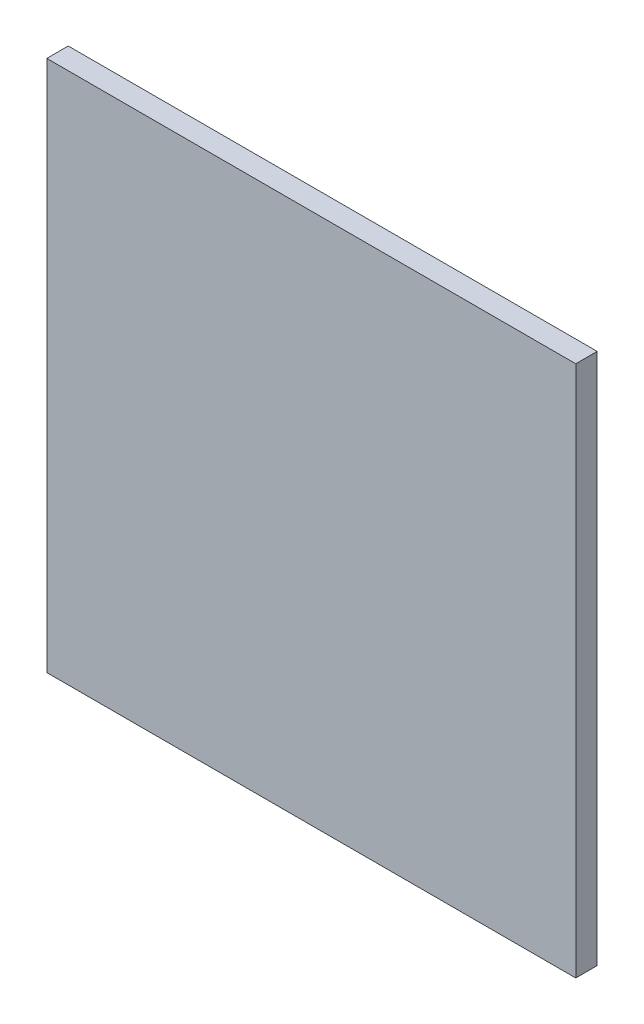
ISO-10303-21;
HEADER;
FILE_DESCRIPTION(('STEP AP214'),'2;1');
FILE_NAME('part.step','',(''),(''),'','','');
FILE_SCHEMA(('AUTOMOTIVE_DESIGN { 1 0 10303 214 1 1 1 1 }'));
ENDSEC;
DATA;
#1=APPLICATION_CONTEXT('core data for automotive mechanical design processes');
#2=APPLICATION_PROTOCOL_DEFINITION('international standard','automotive_design',2000,#1);
#3=PRODUCT_CONTEXT('',#1,'mechanical');
#4=PRODUCT('Part','Part','',(#3));
#5=PRODUCT_RELATED_PRODUCT_CATEGORY('part','',(#4));
#6=PRODUCT_DEFINITION_FORMATION('','',#4);
#7=PRODUCT_DEFINITION_CONTEXT('part definition',#1,'design');
#8=PRODUCT_DEFINITION('design','',#6,#7);
#9=PRODUCT_DEFINITION_SHAPE('','',#8);
#10=(LENGTH_UNIT() NAMED_UNIT(*) SI_UNIT(.MILLI.,.METRE.));
#11=(NAMED_UNIT(*) PLANE_ANGLE_UNIT() SI_UNIT($,.RADIAN.));
#12=(NAMED_UNIT(*) SI_UNIT($,.STERADIAN.) SOLID_ANGLE_UNIT());
#13=UNCERTAINTY_MEASURE_WITH_UNIT(LENGTH_MEASURE(1.E-05),#10,'distance_accuracy_value','');
#14=(GEOMETRIC_REPRESENTATION_CONTEXT(3) GLOBAL_UNCERTAINTY_ASSIGNED_CONTEXT((#13)) GLOBAL_UNIT_ASSIGNED_CONTEXT((#10,
#11,#12)) REPRESENTATION_CONTEXT('',''));
#15=CARTESIAN_POINT('',(0.,0.,0.));
#16=DIRECTION('',(0.,0.,1.));
#17=DIRECTION('',(1.,0.,0.));
#18=AXIS2_PLACEMENT_3D('',#15,#16,#17);
#19=CARTESIAN_POINT('',(-9.83295000067563,239.780501109742,178.407141652104));
#20=DIRECTION('',(1.,0.,0.));
#21=DIRECTION('',(0.,1.,0.));
#22=AXIS2_PLACEMENT_3D('',#19,#20,#21);
#23=PLANE('',#22);
#24=DIRECTION('',(0.,-1.,0.));
#25=VECTOR('',#24,1.);
#26=CARTESIAN_POINT('',(-9.83295000067563,239.780501109742,172.407141652104));
#27=LINE('',#26,#25);
#28=CARTESIAN_POINT('',(-9.83295000067563,239.780501109742,172.407141652104));
#29=VERTEX_POINT('',#28);
#30=CARTESIAN_POINT('',(-9.83295000067561,90.9461939042299,172.407141652104));
#31=VERTEX_POINT('',#30);
#32=EDGE_CURVE('E96',#29,#31,#27,.T.);
#33=ORIENTED_EDGE('',*,*,#32,.T.);
#34=DIRECTION('',(0.,0.,-1.));
#35=VECTOR('',#34,1.);
#36=CARTESIAN_POINT('',(-9.83295000067561,90.9461939042299,178.407141652104));
#37=LINE('',#36,#35);
#38=CARTESIAN_POINT('',(-9.83295000067561,90.9461939042299,178.407141652104));
#39=VERTEX_POINT('',#38);
#40=EDGE_CURVE('E11',#39,#31,#37,.T.);
#41=ORIENTED_EDGE('',*,*,#40,.F.);
#42=DIRECTION('',(0.,-1.,0.));
#43=VECTOR('',#42,1.);
#44=CARTESIAN_POINT('',(-9.83295000067563,239.780501109742,178.407141652104));
#45=LINE('',#44,#43);
#46=CARTESIAN_POINT('',(-9.83295000067563,239.780501109742,178.407141652104));
#47=VERTEX_POINT('',#46);
#48=EDGE_CURVE('E84',#47,#39,#45,.T.);
#49=ORIENTED_EDGE('',*,*,#48,.F.);
#50=DIRECTION('',(0.,0.,-1.));
#51=VECTOR('',#50,1.);
#52=CARTESIAN_POINT('',(-9.83295000067563,239.780501109742,178.407141652104));
#53=LINE('',#52,#51);
#54=EDGE_CURVE('E92',#47,#29,#53,.T.);
#55=ORIENTED_EDGE('',*,*,#54,.T.);
#56=EDGE_LOOP('',(#33,#41,#49,#55));
#57=FACE_BOUND('',#56,.T.);
#58=ADVANCED_FACE('F33',(#57),#23,.F.);
#59=CARTESIAN_POINT('',(-9.83295000067561,90.9461939042299,178.407141652104));
#60=DIRECTION('',(0.,1.,0.));
#61=DIRECTION('',(0.,0.,1.));
#62=AXIS2_PLACEMENT_3D('',#59,#60,#61);
#63=PLANE('',#62);
#64=DIRECTION('',(1.,0.,0.));
#65=VECTOR('',#64,1.);
#66=CARTESIAN_POINT('',(-9.83295000067561,90.9461939042299,172.407141652104));
#67=LINE('',#66,#65);
#68=CARTESIAN_POINT('',(138.167049999324,90.9461939042299,172.407141652104));
#69=VERTEX_POINT('',#68);
#70=EDGE_CURVE('E88',#31,#69,#67,.T.);
#71=ORIENTED_EDGE('',*,*,#70,.T.);
#72=DIRECTION('',(0.,0.,-1.));
#73=VECTOR('',#72,1.);
#74=CARTESIAN_POINT('',(138.167049999324,90.9461939042299,178.407141652104));
#75=LINE('',#74,#73);
#76=CARTESIAN_POINT('',(138.167049999324,90.9461939042299,178.407141652104));
#77=VERTEX_POINT('',#76);
#78=EDGE_CURVE('E41',#77,#69,#75,.T.);
#79=ORIENTED_EDGE('',*,*,#78,.F.);
#80=DIRECTION('',(1.,0.,0.));
#81=VECTOR('',#80,1.);
#82=CARTESIAN_POINT('',(-9.83295000067561,90.9461939042299,178.407141652104));
#83=LINE('',#82,#81);
#84=EDGE_CURVE('E79',#39,#77,#83,.T.);
#85=ORIENTED_EDGE('',*,*,#84,.F.);
#86=ORIENTED_EDGE('',*,*,#40,.T.);
#87=EDGE_LOOP('',(#71,#79,#85,#86));
#88=FACE_BOUND('',#87,.T.);
#89=ADVANCED_FACE('F87',(#88),#63,.F.);
#90=CARTESIAN_POINT('',(138.167049999324,239.780501109742,178.407141652104));
#91=DIRECTION('',(-1.,0.,0.));
#92=DIRECTION('',(0.,-1.,0.));
#93=AXIS2_PLACEMENT_3D('',#90,#91,#92);
#94=PLANE('',#93);
#95=DIRECTION('',(0.,1.,0.));
#96=VECTOR('',#95,1.);
#97=CARTESIAN_POINT('',(138.167049999324,239.780501109742,172.407141652104));
#98=LINE('',#97,#96);
#99=CARTESIAN_POINT('',(138.167049999324,239.780501109742,172.407141652104));
#100=VERTEX_POINT('',#99);
#101=EDGE_CURVE('E66',#69,#100,#98,.T.);
#102=ORIENTED_EDGE('',*,*,#101,.T.);
#103=DIRECTION('',(0.,0.,-1.));
#104=VECTOR('',#103,1.);
#105=CARTESIAN_POINT('',(138.167049999324,239.780501109742,178.407141652104));
#106=LINE('',#105,#104);
#107=CARTESIAN_POINT('',(138.167049999324,239.780501109742,178.407141652104));
#108=VERTEX_POINT('',#107);
#109=EDGE_CURVE('E89',#108,#100,#106,.T.);
#110=ORIENTED_EDGE('',*,*,#109,.F.);
#111=DIRECTION('',(0.,1.,0.));
#112=VECTOR('',#111,1.);
#113=CARTESIAN_POINT('',(138.167049999324,239.780501109742,178.407141652104));
#114=LINE('',#113,#112);
#115=EDGE_CURVE('E82',#77,#108,#114,.T.);
#116=ORIENTED_EDGE('',*,*,#115,.F.);
#117=ORIENTED_EDGE('',*,*,#78,.T.);
#118=EDGE_LOOP('',(#102,#110,#116,#117));
#119=FACE_BOUND('',#118,.T.);
#120=ADVANCED_FACE('F90',(#119),#94,.F.);
#121=CARTESIAN_POINT('',(-9.83295000067563,239.780501109742,178.407141652104));
#122=DIRECTION('',(0.,-1.,0.));
#123=DIRECTION('',(0.,0.,-1.));
#124=AXIS2_PLACEMENT_3D('',#121,#122,#123);
#125=PLANE('',#124);
#126=DIRECTION('',(-1.,0.,0.));
#127=VECTOR('',#126,1.);
#128=CARTESIAN_POINT('',(-9.83295000067563,239.780501109742,172.407141652104));
#129=LINE('',#128,#127);
#130=EDGE_CURVE('E72',#100,#29,#129,.T.);
#131=ORIENTED_EDGE('',*,*,#130,.T.);
#132=ORIENTED_EDGE('',*,*,#54,.F.);
#133=DIRECTION('',(-1.,0.,0.));
#134=VECTOR('',#133,1.);
#135=CARTESIAN_POINT('',(-9.83295000067563,239.780501109742,178.407141652104));
#136=LINE('',#135,#134);
#137=EDGE_CURVE('E49',#108,#47,#136,.T.);
#138=ORIENTED_EDGE('',*,*,#137,.F.);
#139=ORIENTED_EDGE('',*,*,#109,.T.);
#140=EDGE_LOOP('',(#131,#132,#138,#139));
#141=FACE_BOUND('',#140,.T.);
#142=ADVANCED_FACE('F103',(#141),#125,.F.);
#143=CARTESIAN_POINT('',(0.,0.,178.407141652104));
#144=DIRECTION('',(0.,0.,1.));
#145=DIRECTION('',(1.,0.,0.));
#146=AXIS2_PLACEMENT_3D('',#143,#144,#145);
#147=PLANE('',#146);
#148=ORIENTED_EDGE('',*,*,#48,.T.);
#149=ORIENTED_EDGE('',*,*,#84,.T.);
#150=ORIENTED_EDGE('',*,*,#115,.T.);
#151=ORIENTED_EDGE('',*,*,#137,.T.);
#152=EDGE_LOOP('',(#148,#149,#150,#151));
#153=FACE_BOUND('',#152,.T.);
#154=ADVANCED_FACE('F80',(#153),#147,.T.);
#155=CARTESIAN_POINT('',(0.,0.,172.407141652104));
#156=DIRECTION('',(0.,0.,1.));
#157=DIRECTION('',(1.,0.,0.));
#158=AXIS2_PLACEMENT_3D('',#155,#156,#157);
#159=PLANE('',#158);
#160=ORIENTED_EDGE('',*,*,#32,.F.);
#161=ORIENTED_EDGE('',*,*,#130,.F.);
#162=ORIENTED_EDGE('',*,*,#101,.F.);
#163=ORIENTED_EDGE('',*,*,#70,.F.);
#164=EDGE_LOOP('',(#160,#161,#162,#163));
#165=FACE_BOUND('',#164,.T.);
#166=ADVANCED_FACE('F106',(#165),#159,.F.);
#167=CLOSED_SHELL('',(#58,#89,#120,#142,#154,#166));
#168=MANIFOLD_SOLID_BREP('B2',#167);
#169=ADVANCED_BREP_SHAPE_REPRESENTATION('',(#18,#168),#14);
#170=SHAPE_DEFINITION_REPRESENTATION(#9,#169);
ENDSEC;
END-ISO-10303-21;
